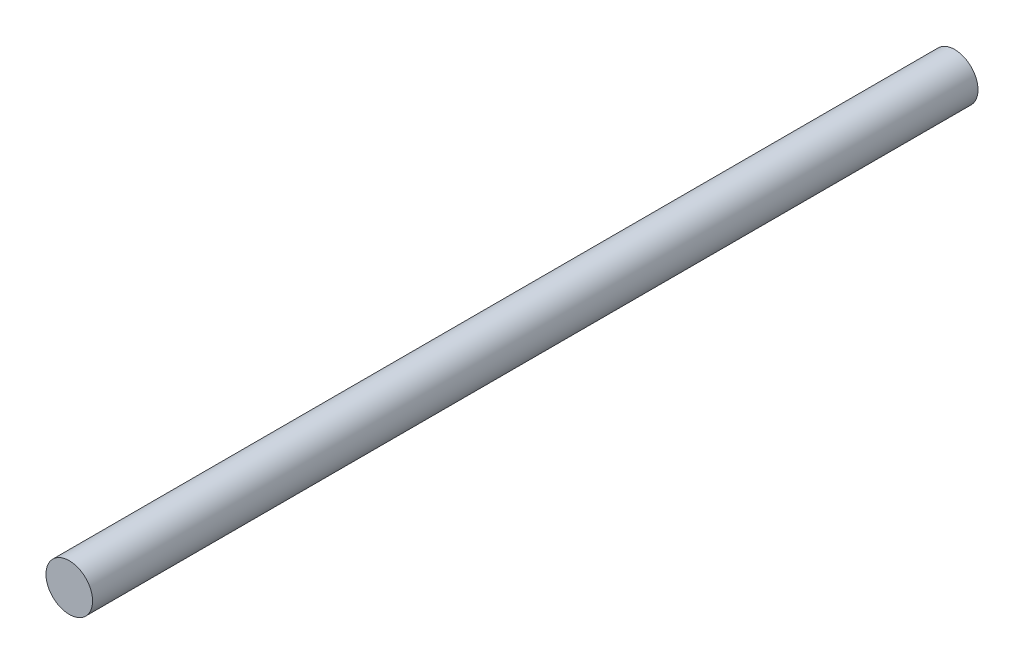
ISO-10303-21;
HEADER;
FILE_DESCRIPTION(('STEP AP214'),'2;1');
FILE_NAME('part.step','',(''),(''),'','','');
FILE_SCHEMA(('AUTOMOTIVE_DESIGN { 1 0 10303 214 1 1 1 1 }'));
ENDSEC;
DATA;
#1=APPLICATION_CONTEXT('core data for automotive mechanical design processes');
#2=APPLICATION_PROTOCOL_DEFINITION('international standard','automotive_design',2000,#1);
#3=PRODUCT_CONTEXT('',#1,'mechanical');
#4=PRODUCT('Part','Part','',(#3));
#5=PRODUCT_RELATED_PRODUCT_CATEGORY('part','',(#4));
#6=PRODUCT_DEFINITION_FORMATION('','',#4);
#7=PRODUCT_DEFINITION_CONTEXT('part definition',#1,'design');
#8=PRODUCT_DEFINITION('design','',#6,#7);
#9=PRODUCT_DEFINITION_SHAPE('','',#8);
#10=(LENGTH_UNIT() NAMED_UNIT(*) SI_UNIT(.MILLI.,.METRE.));
#11=(NAMED_UNIT(*) PLANE_ANGLE_UNIT() SI_UNIT($,.RADIAN.));
#12=(NAMED_UNIT(*) SI_UNIT($,.STERADIAN.) SOLID_ANGLE_UNIT());
#13=UNCERTAINTY_MEASURE_WITH_UNIT(LENGTH_MEASURE(1.E-05),#10,'distance_accuracy_value','');
#14=(GEOMETRIC_REPRESENTATION_CONTEXT(3) GLOBAL_UNCERTAINTY_ASSIGNED_CONTEXT((#13)) GLOBAL_UNIT_ASSIGNED_CONTEXT((#10,
#11,#12)) REPRESENTATION_CONTEXT('',''));
#15=CARTESIAN_POINT('',(0.,0.,0.));
#16=DIRECTION('',(0.,0.,1.));
#17=DIRECTION('',(1.,0.,0.));
#18=AXIS2_PLACEMENT_3D('',#15,#16,#17);
#19=CARTESIAN_POINT('',(0.,0.,190.));
#20=DIRECTION('',(0.,0.,-1.));
#21=DIRECTION('',(-1.,0.,0.));
#22=AXIS2_PLACEMENT_3D('',#19,#20,#21);
#23=CYLINDRICAL_SURFACE('',#22,5.);
#24=CARTESIAN_POINT('',(0.,0.,190.));
#25=DIRECTION('',(0.,0.,1.));
#26=DIRECTION('',(1.,0.,0.));
#27=AXIS2_PLACEMENT_3D('',#24,#25,#26);
#28=CIRCLE('',#27,5.);
#29=CARTESIAN_POINT('',(5.,0.,190.));
#30=VERTEX_POINT('',#29);
#31=EDGE_CURVE('E10',#30,#30,#28,.T.);
#32=ORIENTED_EDGE('',*,*,#31,.F.);
#33=EDGE_LOOP('',(#32));
#34=FACE_BOUND('',#33,.T.);
#35=CARTESIAN_POINT('',(0.,0.,0.));
#36=DIRECTION('',(0.,0.,1.));
#37=DIRECTION('',(1.,0.,0.));
#38=AXIS2_PLACEMENT_3D('',#35,#36,#37);
#39=CIRCLE('',#38,5.);
#40=CARTESIAN_POINT('',(5.,0.,0.));
#41=VERTEX_POINT('',#40);
#42=EDGE_CURVE('E34',#41,#41,#39,.T.);
#43=ORIENTED_EDGE('',*,*,#42,.T.);
#44=EDGE_LOOP('',(#43));
#45=FACE_BOUND('',#44,.T.);
#46=ADVANCED_FACE('F31',(#34,#45),#23,.T.);
#47=CARTESIAN_POINT('',(0.,0.,190.));
#48=DIRECTION('',(0.,0.,1.));
#49=DIRECTION('',(1.,0.,0.));
#50=AXIS2_PLACEMENT_3D('',#47,#48,#49);
#51=PLANE('',#50);
#52=ORIENTED_EDGE('',*,*,#31,.T.);
#53=EDGE_LOOP('',(#52));
#54=FACE_BOUND('',#53,.T.);
#55=ADVANCED_FACE('F46',(#54),#51,.T.);
#56=CARTESIAN_POINT('',(0.,0.,0.));
#57=DIRECTION('',(0.,0.,1.));
#58=DIRECTION('',(1.,0.,0.));
#59=AXIS2_PLACEMENT_3D('',#56,#57,#58);
#60=PLANE('',#59);
#61=ORIENTED_EDGE('',*,*,#42,.F.);
#62=EDGE_LOOP('',(#61));
#63=FACE_BOUND('',#62,.T.);
#64=ADVANCED_FACE('F44',(#63),#60,.F.);
#65=CLOSED_SHELL('',(#46,#55,#64));
#66=MANIFOLD_SOLID_BREP('B2',#65);
#67=ADVANCED_BREP_SHAPE_REPRESENTATION('',(#18,#66),#14);
#68=SHAPE_DEFINITION_REPRESENTATION(#9,#67);
ENDSEC;
END-ISO-10303-21;
